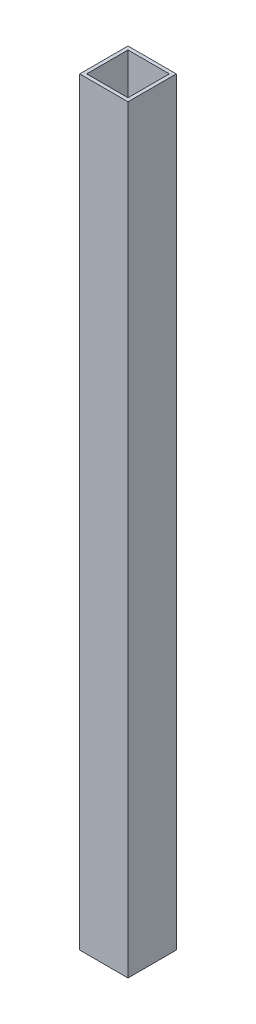
ISO-10303-21;
HEADER;
FILE_DESCRIPTION(('STEP AP214'),'2;1');
FILE_NAME('part.step','',(''),(''),'','','');
FILE_SCHEMA(('AUTOMOTIVE_DESIGN { 1 0 10303 214 1 1 1 1 }'));
ENDSEC;
DATA;
#1=APPLICATION_CONTEXT('core data for automotive mechanical design processes');
#2=APPLICATION_PROTOCOL_DEFINITION('international standard','automotive_design',2000,#1);
#3=PRODUCT_CONTEXT('',#1,'mechanical');
#4=PRODUCT('Part','Part','',(#3));
#5=PRODUCT_RELATED_PRODUCT_CATEGORY('part','',(#4));
#6=PRODUCT_DEFINITION_FORMATION('','',#4);
#7=PRODUCT_DEFINITION_CONTEXT('part definition',#1,'design');
#8=PRODUCT_DEFINITION('design','',#6,#7);
#9=PRODUCT_DEFINITION_SHAPE('','',#8);
#10=(LENGTH_UNIT() NAMED_UNIT(*) SI_UNIT(.MILLI.,.METRE.));
#11=(NAMED_UNIT(*) PLANE_ANGLE_UNIT() SI_UNIT($,.RADIAN.));
#12=(NAMED_UNIT(*) SI_UNIT($,.STERADIAN.) SOLID_ANGLE_UNIT());
#13=UNCERTAINTY_MEASURE_WITH_UNIT(LENGTH_MEASURE(1.E-05),#10,'distance_accuracy_value','');
#14=(GEOMETRIC_REPRESENTATION_CONTEXT(3) GLOBAL_UNCERTAINTY_ASSIGNED_CONTEXT((#13)) GLOBAL_UNIT_ASSIGNED_CONTEXT((#10,
#11,#12)) REPRESENTATION_CONTEXT('',''));
#15=CARTESIAN_POINT('',(0.,0.,0.));
#16=DIRECTION('',(0.,0.,1.));
#17=DIRECTION('',(1.,0.,0.));
#18=AXIS2_PLACEMENT_3D('',#15,#16,#17);
#19=CARTESIAN_POINT('',(-609.599999999995,42.4473088562491,-298.450000000003));
#20=DIRECTION('',(0.,0.,-1.00000000000001));
#21=DIRECTION('',(0.,0.999999999999997,0.));
#22=AXIS2_PLACEMENT_3D('',#19,#20,#21);
#23=PLANE('',#22);
#24=DIRECTION('',(0.999999999999997,0.,0.));
#25=VECTOR('',#24,1.);
#26=CARTESIAN_POINT('',(-609.599999999995,676.274999999998,-298.450000000004));
#27=LINE('',#26,#25);
#28=CARTESIAN_POINT('',(-565.149999999992,676.275,-298.450000000003));
#29=VERTEX_POINT('',#28);
#30=CARTESIAN_POINT('',(-609.599999999995,676.274999999998,-298.450000000004));
#31=VERTEX_POINT('',#30);
#32=EDGE_CURVE('E129',#29,#31,#27,.F.);
#33=ORIENTED_EDGE('',*,*,#32,.T.);
#34=DIRECTION('',(0.,0.999999999999997,0.));
#35=VECTOR('',#34,1.);
#36=CARTESIAN_POINT('',(-609.599999999997,155.574999999999,-298.450000000004));
#37=LINE('',#36,#35);
#38=CARTESIAN_POINT('',(-609.599999999995,-22.225,-298.450000000003));
#39=VERTEX_POINT('',#38);
#40=EDGE_CURVE('E127',#39,#31,#37,.T.);
#41=ORIENTED_EDGE('',*,*,#40,.F.);
#42=DIRECTION('',(0.999999999999997,0.,0.));
#43=VECTOR('',#42,1.);
#44=CARTESIAN_POINT('',(-609.599999999995,-22.225,-298.450000000003));
#45=LINE('',#44,#43);
#46=CARTESIAN_POINT('',(-565.149999999992,-22.225,-298.450000000003));
#47=VERTEX_POINT('',#46);
#48=EDGE_CURVE('E104',#47,#39,#45,.F.);
#49=ORIENTED_EDGE('',*,*,#48,.F.);
#50=DIRECTION('',(0.,0.999999999999997,0.));
#51=VECTOR('',#50,1.);
#52=CARTESIAN_POINT('',(-565.149999999995,155.574999999999,-298.450000000002));
#53=LINE('',#52,#51);
#54=EDGE_CURVE('E112',#47,#29,#53,.T.);
#55=ORIENTED_EDGE('',*,*,#54,.T.);
#56=EDGE_LOOP('',(#33,#41,#49,#55));
#57=FACE_BOUND('',#56,.T.);
#58=ADVANCED_FACE('F14',(#57),#23,.F.);
#59=CARTESIAN_POINT('',(-609.599999999995,3013.21950277303,-339.725000000004));
#60=DIRECTION('',(0.,0.,-1.00000000000001));
#61=DIRECTION('',(0.,0.999999999999997,0.));
#62=AXIS2_PLACEMENT_3D('',#59,#60,#61);
#63=PLANE('',#62);
#64=DIRECTION('',(0.999999999999997,0.,0.));
#65=VECTOR('',#64,1.);
#66=CARTESIAN_POINT('',(-609.599999999995,-22.225,-339.725000000004));
#67=LINE('',#66,#65);
#68=CARTESIAN_POINT('',(-568.324999999995,-22.2250000000001,-339.725000000005));
#69=VERTEX_POINT('',#68);
#70=CARTESIAN_POINT('',(-606.424999999996,-22.2250000000001,-339.725000000005));
#71=VERTEX_POINT('',#70);
#72=EDGE_CURVE('E98',#69,#71,#67,.F.);
#73=ORIENTED_EDGE('',*,*,#72,.F.);
#74=DIRECTION('',(0.,0.999999999999997,0.));
#75=VECTOR('',#74,1.);
#76=CARTESIAN_POINT('',(-568.324999999995,3013.21950277302,-339.725000000004));
#77=LINE('',#76,#75);
#78=CARTESIAN_POINT('',(-568.324999999995,676.275,-339.725000000004));
#79=VERTEX_POINT('',#78);
#80=EDGE_CURVE('E89',#79,#69,#77,.F.);
#81=ORIENTED_EDGE('',*,*,#80,.F.);
#82=DIRECTION('',(0.999999999999997,0.,0.));
#83=VECTOR('',#82,1.);
#84=CARTESIAN_POINT('',(-609.599999999995,676.274999999999,-339.725000000004));
#85=LINE('',#84,#83);
#86=CARTESIAN_POINT('',(-606.424999999995,676.274999999999,-339.725000000004));
#87=VERTEX_POINT('',#86);
#88=EDGE_CURVE('E118',#79,#87,#85,.F.);
#89=ORIENTED_EDGE('',*,*,#88,.T.);
#90=DIRECTION('',(0.,0.999999999999997,0.));
#91=VECTOR('',#90,1.);
#92=CARTESIAN_POINT('',(-606.424999999995,3013.21950277302,-339.725000000004));
#93=LINE('',#92,#91);
#94=EDGE_CURVE('E17',#87,#71,#93,.F.);
#95=ORIENTED_EDGE('',*,*,#94,.T.);
#96=EDGE_LOOP('',(#73,#81,#89,#95));
#97=FACE_BOUND('',#96,.T.);
#98=ADVANCED_FACE('F116',(#97),#63,.F.);
#99=CARTESIAN_POINT('',(-606.424999999995,3013.21950277302,-298.450000000004));
#100=DIRECTION('',(-0.999999999999997,0.,0.));
#101=DIRECTION('',(0.,0.,1.00000000000001));
#102=AXIS2_PLACEMENT_3D('',#99,#100,#101);
#103=PLANE('',#102);
#104=DIRECTION('',(0.,0.,-1.00000000000001));
#105=VECTOR('',#104,1.);
#106=CARTESIAN_POINT('',(-606.424999999995,-22.225,-298.450000000003));
#107=LINE('',#106,#105);
#108=CARTESIAN_POINT('',(-606.424999999995,-22.2250000000001,-301.625000000004));
#109=VERTEX_POINT('',#108);
#110=EDGE_CURVE('E103',#71,#109,#107,.F.);
#111=ORIENTED_EDGE('',*,*,#110,.F.);
#112=ORIENTED_EDGE('',*,*,#94,.F.);
#113=DIRECTION('',(0.,0.,-1.00000000000001));
#114=VECTOR('',#113,1.);
#115=CARTESIAN_POINT('',(-606.424999999995,676.274999999998,-317.500000000003));
#116=LINE('',#115,#114);
#117=CARTESIAN_POINT('',(-606.424999999995,676.274999999999,-301.625000000003));
#118=VERTEX_POINT('',#117);
#119=EDGE_CURVE('E136',#87,#118,#116,.F.);
#120=ORIENTED_EDGE('',*,*,#119,.T.);
#121=DIRECTION('',(0.,0.999999999999997,0.));
#122=VECTOR('',#121,1.);
#123=CARTESIAN_POINT('',(-606.424999999995,3013.21950277302,-301.625000000004));
#124=LINE('',#123,#122);
#125=EDGE_CURVE('E90',#109,#118,#124,.T.);
#126=ORIENTED_EDGE('',*,*,#125,.F.);
#127=EDGE_LOOP('',(#111,#112,#120,#126));
#128=FACE_BOUND('',#127,.T.);
#129=ADVANCED_FACE('F121',(#128),#103,.F.);
#130=CARTESIAN_POINT('',(-609.599999999995,3013.21950277303,-301.625000000004));
#131=DIRECTION('',(0.,0.,-1.00000000000001));
#132=DIRECTION('',(0.,0.999999999999997,0.));
#133=AXIS2_PLACEMENT_3D('',#130,#131,#132);
#134=PLANE('',#133);
#135=DIRECTION('',(0.,0.999999999999997,0.));
#136=VECTOR('',#135,1.);
#137=CARTESIAN_POINT('',(-568.324999999995,3013.21950277302,-301.625000000003));
#138=LINE('',#137,#136);
#139=CARTESIAN_POINT('',(-568.324999999995,-22.2250000000001,-301.625000000004));
#140=VERTEX_POINT('',#139);
#141=CARTESIAN_POINT('',(-568.324999999995,676.275,-301.625000000003));
#142=VERTEX_POINT('',#141);
#143=EDGE_CURVE('E77',#140,#142,#138,.T.);
#144=ORIENTED_EDGE('',*,*,#143,.F.);
#145=DIRECTION('',(0.999999999999997,0.,0.));
#146=VECTOR('',#145,1.);
#147=CARTESIAN_POINT('',(-609.599999999995,-22.225,-301.625000000003));
#148=LINE('',#147,#146);
#149=EDGE_CURVE('E82',#109,#140,#148,.T.);
#150=ORIENTED_EDGE('',*,*,#149,.F.);
#151=ORIENTED_EDGE('',*,*,#125,.T.);
#152=DIRECTION('',(0.999999999999997,0.,0.));
#153=VECTOR('',#152,1.);
#154=CARTESIAN_POINT('',(-609.599999999995,676.274999999999,-301.625000000003));
#155=LINE('',#154,#153);
#156=EDGE_CURVE('E85',#118,#142,#155,.T.);
#157=ORIENTED_EDGE('',*,*,#156,.T.);
#158=EDGE_LOOP('',(#144,#150,#151,#157));
#159=FACE_BOUND('',#158,.T.);
#160=ADVANCED_FACE('F79',(#159),#134,.T.);
#161=CARTESIAN_POINT('',(-568.324999999995,3013.21950277302,-298.450000000002));
#162=DIRECTION('',(-0.999999999999997,0.,0.));
#163=DIRECTION('',(0.,0.,1.00000000000001));
#164=AXIS2_PLACEMENT_3D('',#161,#162,#163);
#165=PLANE('',#164);
#166=ORIENTED_EDGE('',*,*,#80,.T.);
#167=DIRECTION('',(0.,0.,-1.00000000000001));
#168=VECTOR('',#167,1.);
#169=CARTESIAN_POINT('',(-568.324999999998,-22.225,-298.450000000004));
#170=LINE('',#169,#168);
#171=EDGE_CURVE('E93',#140,#69,#170,.T.);
#172=ORIENTED_EDGE('',*,*,#171,.F.);
#173=ORIENTED_EDGE('',*,*,#143,.T.);
#174=DIRECTION('',(0.,0.,-1.00000000000001));
#175=VECTOR('',#174,1.);
#176=CARTESIAN_POINT('',(-568.324999999995,676.275,-317.500000000002));
#177=LINE('',#176,#175);
#178=EDGE_CURVE('E139',#142,#79,#177,.T.);
#179=ORIENTED_EDGE('',*,*,#178,.T.);
#180=EDGE_LOOP('',(#166,#172,#173,#179));
#181=FACE_BOUND('',#180,.T.);
#182=ADVANCED_FACE('F94',(#181),#165,.T.);
#183=CARTESIAN_POINT('',(-565.149999999997,155.574999999999,-320.675000000003));
#184=DIRECTION('',(-0.999999999999997,0.,0.));
#185=DIRECTION('',(0.,0.,1.00000000000001));
#186=AXIS2_PLACEMENT_3D('',#183,#184,#185);
#187=PLANE('',#186);
#188=DIRECTION('',(0.,0.,-1.00000000000001));
#189=VECTOR('',#188,1.);
#190=CARTESIAN_POINT('',(-565.149999999993,676.275,-317.500000000002));
#191=LINE('',#190,#189);
#192=CARTESIAN_POINT('',(-565.149999999993,676.275,-342.900000000004));
#193=VERTEX_POINT('',#192);
#194=EDGE_CURVE('E132',#193,#29,#191,.F.);
#195=ORIENTED_EDGE('',*,*,#194,.T.);
#196=ORIENTED_EDGE('',*,*,#54,.F.);
#197=DIRECTION('',(0.,0.,-1.00000000000001));
#198=VECTOR('',#197,1.);
#199=CARTESIAN_POINT('',(-565.149999999992,-22.225,-298.450000000003));
#200=LINE('',#199,#198);
#201=CARTESIAN_POINT('',(-565.149999999992,-22.225,-342.900000000004));
#202=VERTEX_POINT('',#201);
#203=EDGE_CURVE('E106',#202,#47,#200,.F.);
#204=ORIENTED_EDGE('',*,*,#203,.F.);
#205=DIRECTION('',(0.,0.999999999999997,0.));
#206=VECTOR('',#205,1.);
#207=CARTESIAN_POINT('',(-565.149999999992,45.6223088562482,-342.900000000004));
#208=LINE('',#207,#206);
#209=EDGE_CURVE('E141',#193,#202,#208,.F.);
#210=ORIENTED_EDGE('',*,*,#209,.F.);
#211=EDGE_LOOP('',(#195,#196,#204,#210));
#212=FACE_BOUND('',#211,.T.);
#213=ADVANCED_FACE('F161',(#212),#187,.F.);
#214=CARTESIAN_POINT('',(-609.599999999995,-22.225,-298.450000000003));
#215=DIRECTION('',(0.,-0.999999999999997,0.));
#216=DIRECTION('',(0.,0.,-1.00000000000001));
#217=AXIS2_PLACEMENT_3D('',#214,#215,#216);
#218=PLANE('',#217);
#219=ORIENTED_EDGE('',*,*,#72,.T.);
#220=ORIENTED_EDGE('',*,*,#110,.T.);
#221=ORIENTED_EDGE('',*,*,#149,.T.);
#222=ORIENTED_EDGE('',*,*,#171,.T.);
#223=EDGE_LOOP('',(#219,#220,#221,#222));
#224=FACE_BOUND('',#223,.T.);
#225=DIRECTION('',(0.,0.,1.00000000000001));
#226=VECTOR('',#225,1.);
#227=CARTESIAN_POINT('',(-609.599999999995,-22.225,-320.675000000003));
#228=LINE('',#227,#226);
#229=CARTESIAN_POINT('',(-609.599999999995,-22.225,-342.900000000004));
#230=VERTEX_POINT('',#229);
#231=EDGE_CURVE('E122',#230,#39,#228,.T.);
#232=ORIENTED_EDGE('',*,*,#231,.F.);
#233=DIRECTION('',(-0.999999999999997,0.,0.));
#234=VECTOR('',#233,1.);
#235=CARTESIAN_POINT('',(-609.599999999995,-22.225,-342.900000000004));
#236=LINE('',#235,#234);
#237=EDGE_CURVE('E144',#202,#230,#236,.T.);
#238=ORIENTED_EDGE('',*,*,#237,.F.);
#239=ORIENTED_EDGE('',*,*,#203,.T.);
#240=ORIENTED_EDGE('',*,*,#48,.T.);
#241=EDGE_LOOP('',(#232,#238,#239,#240));
#242=FACE_BOUND('',#241,.T.);
#243=ADVANCED_FACE('F100',(#224,#242),#218,.T.);
#244=CARTESIAN_POINT('',(-609.599999999997,155.574999999999,-320.675000000004));
#245=DIRECTION('',(-0.999999999999997,0.,0.));
#246=DIRECTION('',(0.,0.,1.00000000000001));
#247=AXIS2_PLACEMENT_3D('',#244,#245,#246);
#248=PLANE('',#247);
#249=ORIENTED_EDGE('',*,*,#40,.T.);
#250=DIRECTION('',(0.,0.,-1.00000000000001));
#251=VECTOR('',#250,1.);
#252=CARTESIAN_POINT('',(-609.599999999995,676.274999999998,-317.500000000003));
#253=LINE('',#252,#251);
#254=CARTESIAN_POINT('',(-609.599999999995,676.274999999998,-342.900000000004));
#255=VERTEX_POINT('',#254);
#256=EDGE_CURVE('E32',#31,#255,#253,.T.);
#257=ORIENTED_EDGE('',*,*,#256,.T.);
#258=DIRECTION('',(0.,0.999999999999997,0.));
#259=VECTOR('',#258,1.);
#260=CARTESIAN_POINT('',(-609.599999999995,45.6223088562482,-342.900000000004));
#261=LINE('',#260,#259);
#262=EDGE_CURVE('E23',#230,#255,#261,.T.);
#263=ORIENTED_EDGE('',*,*,#262,.F.);
#264=ORIENTED_EDGE('',*,*,#231,.T.);
#265=EDGE_LOOP('',(#249,#257,#263,#264));
#266=FACE_BOUND('',#265,.T.);
#267=ADVANCED_FACE('F151',(#266),#248,.T.);
#268=CARTESIAN_POINT('',(-609.599999999995,676.274999999998,-317.500000000003));
#269=DIRECTION('',(0.,-0.999999999999997,0.));
#270=DIRECTION('',(0.,0.,-1.00000000000001));
#271=AXIS2_PLACEMENT_3D('',#268,#269,#270);
#272=PLANE('',#271);
#273=ORIENTED_EDGE('',*,*,#156,.F.);
#274=ORIENTED_EDGE('',*,*,#119,.F.);
#275=ORIENTED_EDGE('',*,*,#88,.F.);
#276=ORIENTED_EDGE('',*,*,#178,.F.);
#277=EDGE_LOOP('',(#273,#274,#275,#276));
#278=FACE_BOUND('',#277,.T.);
#279=DIRECTION('',(-0.999999999999997,0.,0.));
#280=VECTOR('',#279,1.);
#281=CARTESIAN_POINT('',(-609.599999999995,676.274999999998,-342.900000000004));
#282=LINE('',#281,#280);
#283=EDGE_CURVE('E9',#255,#193,#282,.F.);
#284=ORIENTED_EDGE('',*,*,#283,.F.);
#285=ORIENTED_EDGE('',*,*,#256,.F.);
#286=ORIENTED_EDGE('',*,*,#32,.F.);
#287=ORIENTED_EDGE('',*,*,#194,.F.);
#288=EDGE_LOOP('',(#284,#285,#286,#287));
#289=FACE_BOUND('',#288,.T.);
#290=ADVANCED_FACE('F159',(#278,#289),#272,.F.);
#291=CARTESIAN_POINT('',(-609.599999999995,45.6223088562482,-342.900000000004));
#292=DIRECTION('',(0.,0.,-1.00000000000001));
#293=DIRECTION('',(-0.999999999999997,0.,0.));
#294=AXIS2_PLACEMENT_3D('',#291,#292,#293);
#295=PLANE('',#294);
#296=ORIENTED_EDGE('',*,*,#262,.T.);
#297=ORIENTED_EDGE('',*,*,#283,.T.);
#298=ORIENTED_EDGE('',*,*,#209,.T.);
#299=ORIENTED_EDGE('',*,*,#237,.T.);
#300=EDGE_LOOP('',(#296,#297,#298,#299));
#301=FACE_BOUND('',#300,.T.);
#302=ADVANCED_FACE('F149',(#301),#295,.T.);
#303=CLOSED_SHELL('',(#58,#98,#129,#160,#182,#213,#243,#267,#290,#302));
#304=MANIFOLD_SOLID_BREP('B1',#303);
#305=ADVANCED_BREP_SHAPE_REPRESENTATION('',(#18,#304),#14);
#306=SHAPE_DEFINITION_REPRESENTATION(#9,#305);
ENDSEC;
END-ISO-10303-21;
